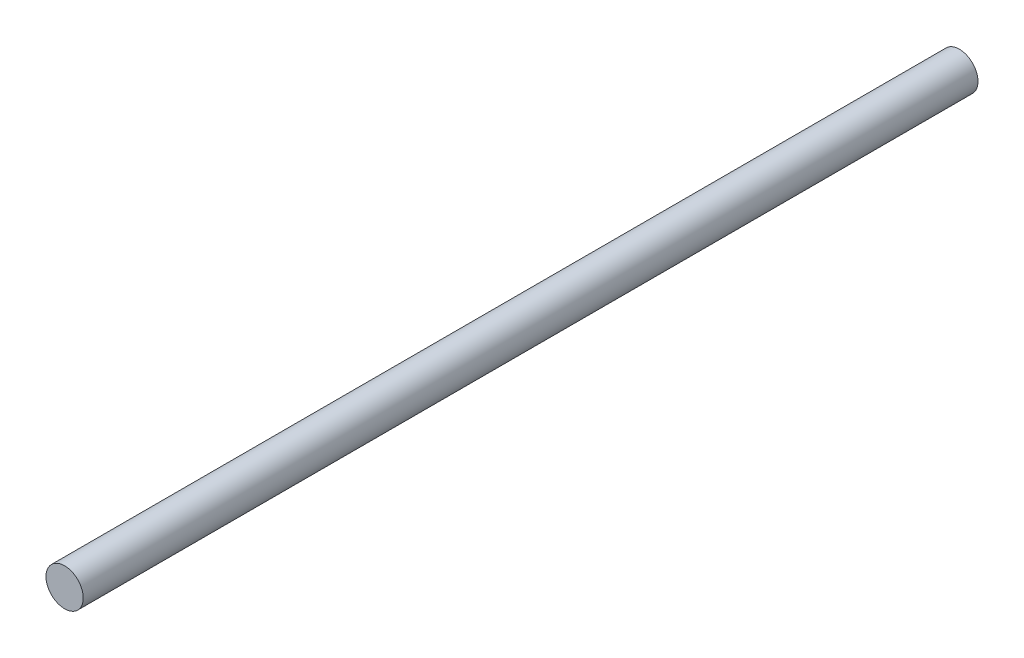
ISO-10303-21;
HEADER;
FILE_DESCRIPTION(('STEP AP214'),'2;1');
FILE_NAME('part.step','',(''),(''),'','','');
FILE_SCHEMA(('AUTOMOTIVE_DESIGN { 1 0 10303 214 1 1 1 1 }'));
ENDSEC;
DATA;
#1=APPLICATION_CONTEXT('core data for automotive mechanical design processes');
#2=APPLICATION_PROTOCOL_DEFINITION('international standard','automotive_design',2000,#1);
#3=PRODUCT_CONTEXT('',#1,'mechanical');
#4=PRODUCT('Part','Part','',(#3));
#5=PRODUCT_RELATED_PRODUCT_CATEGORY('part','',(#4));
#6=PRODUCT_DEFINITION_FORMATION('','',#4);
#7=PRODUCT_DEFINITION_CONTEXT('part definition',#1,'design');
#8=PRODUCT_DEFINITION('design','',#6,#7);
#9=PRODUCT_DEFINITION_SHAPE('','',#8);
#10=(LENGTH_UNIT() NAMED_UNIT(*) SI_UNIT(.MILLI.,.METRE.));
#11=(NAMED_UNIT(*) PLANE_ANGLE_UNIT() SI_UNIT($,.RADIAN.));
#12=(NAMED_UNIT(*) SI_UNIT($,.STERADIAN.) SOLID_ANGLE_UNIT());
#13=UNCERTAINTY_MEASURE_WITH_UNIT(LENGTH_MEASURE(1.E-05),#10,'distance_accuracy_value','');
#14=(GEOMETRIC_REPRESENTATION_CONTEXT(3) GLOBAL_UNCERTAINTY_ASSIGNED_CONTEXT((#13)) GLOBAL_UNIT_ASSIGNED_CONTEXT((#10,
#11,#12)) REPRESENTATION_CONTEXT('',''));
#15=CARTESIAN_POINT('',(0.,0.,0.));
#16=DIRECTION('',(0.,0.,1.));
#17=DIRECTION('',(1.,0.,0.));
#18=AXIS2_PLACEMENT_3D('',#15,#16,#17);
#19=CARTESIAN_POINT('',(0.,0.,48.));
#20=DIRECTION('',(0.,0.,-1.));
#21=DIRECTION('',(-1.,0.,0.));
#22=AXIS2_PLACEMENT_3D('',#19,#20,#21);
#23=CYLINDRICAL_SURFACE('',#22,1.);
#24=CARTESIAN_POINT('',(0.,0.,48.));
#25=DIRECTION('',(0.,0.,1.));
#26=DIRECTION('',(1.,0.,0.));
#27=AXIS2_PLACEMENT_3D('',#24,#25,#26);
#28=CIRCLE('',#27,1.);
#29=CARTESIAN_POINT('',(1.,0.,48.));
#30=VERTEX_POINT('',#29);
#31=EDGE_CURVE('E10',#30,#30,#28,.T.);
#32=ORIENTED_EDGE('',*,*,#31,.F.);
#33=EDGE_LOOP('',(#32));
#34=FACE_BOUND('',#33,.T.);
#35=CARTESIAN_POINT('',(0.,0.,0.));
#36=DIRECTION('',(0.,0.,1.));
#37=DIRECTION('',(1.,0.,0.));
#38=AXIS2_PLACEMENT_3D('',#35,#36,#37);
#39=CIRCLE('',#38,1.);
#40=CARTESIAN_POINT('',(1.,0.,0.));
#41=VERTEX_POINT('',#40);
#42=EDGE_CURVE('E42',#41,#41,#39,.T.);
#43=ORIENTED_EDGE('',*,*,#42,.T.);
#44=EDGE_LOOP('',(#43));
#45=FACE_BOUND('',#44,.T.);
#46=ADVANCED_FACE('F39',(#34,#45),#23,.T.);
#47=CARTESIAN_POINT('',(0.,0.,48.));
#48=DIRECTION('',(0.,0.,1.));
#49=DIRECTION('',(1.,0.,0.));
#50=AXIS2_PLACEMENT_3D('',#47,#48,#49);
#51=PLANE('',#50);
#52=ORIENTED_EDGE('',*,*,#31,.T.);
#53=EDGE_LOOP('',(#52));
#54=FACE_BOUND('',#53,.T.);
#55=ADVANCED_FACE('F56',(#54),#51,.T.);
#56=CARTESIAN_POINT('',(0.,0.,0.));
#57=DIRECTION('',(0.,0.,1.));
#58=DIRECTION('',(1.,0.,0.));
#59=AXIS2_PLACEMENT_3D('',#56,#57,#58);
#60=PLANE('',#59);
#61=ORIENTED_EDGE('',*,*,#42,.F.);
#62=EDGE_LOOP('',(#61));
#63=FACE_BOUND('',#62,.T.);
#64=ADVANCED_FACE('F54',(#63),#60,.F.);
#65=CLOSED_SHELL('',(#46,#55,#64));
#66=MANIFOLD_SOLID_BREP('B2',#65);
#67=ADVANCED_BREP_SHAPE_REPRESENTATION('',(#18,#66),#14);
#68=SHAPE_DEFINITION_REPRESENTATION(#9,#67);
ENDSEC;
END-ISO-10303-21;
